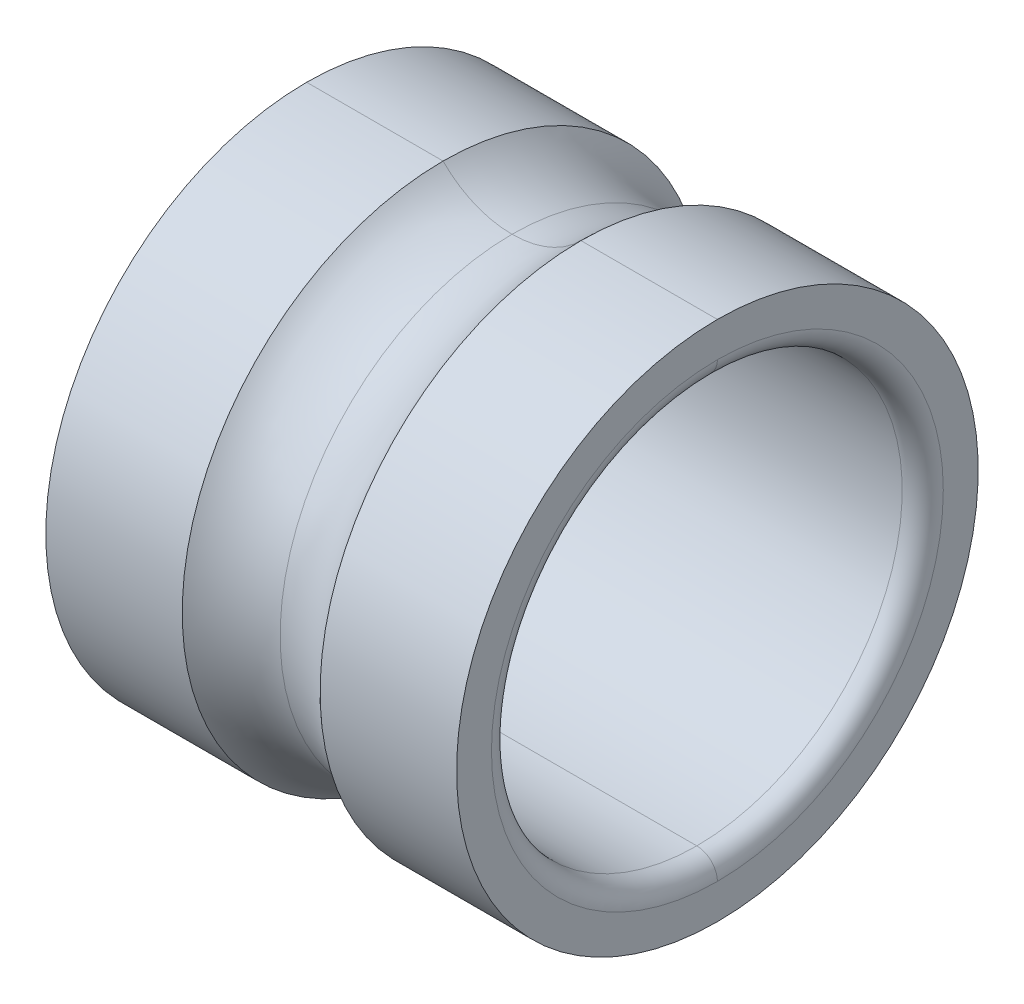
ISO-10303-21;
HEADER;
FILE_DESCRIPTION(('STEP AP214'),'2;1');
FILE_NAME('part.step','',(''),(''),'','','');
FILE_SCHEMA(('AUTOMOTIVE_DESIGN { 1 0 10303 214 1 1 1 1 }'));
ENDSEC;
DATA;
#1=APPLICATION_CONTEXT('core data for automotive mechanical design processes');
#2=APPLICATION_PROTOCOL_DEFINITION('international standard','automotive_design',2000,#1);
#3=PRODUCT_CONTEXT('',#1,'mechanical');
#4=PRODUCT('Part','Part','',(#3));
#5=PRODUCT_RELATED_PRODUCT_CATEGORY('part','',(#4));
#6=PRODUCT_DEFINITION_FORMATION('','',#4);
#7=PRODUCT_DEFINITION_CONTEXT('part definition',#1,'design');
#8=PRODUCT_DEFINITION('design','',#6,#7);
#9=PRODUCT_DEFINITION_SHAPE('','',#8);
#10=(LENGTH_UNIT() NAMED_UNIT(*) SI_UNIT(.MILLI.,.METRE.));
#11=(NAMED_UNIT(*) PLANE_ANGLE_UNIT() SI_UNIT($,.RADIAN.));
#12=(NAMED_UNIT(*) SI_UNIT($,.STERADIAN.) SOLID_ANGLE_UNIT());
#13=UNCERTAINTY_MEASURE_WITH_UNIT(LENGTH_MEASURE(1.E-05),#10,'distance_accuracy_value','');
#14=(GEOMETRIC_REPRESENTATION_CONTEXT(3) GLOBAL_UNCERTAINTY_ASSIGNED_CONTEXT((#13)) GLOBAL_UNIT_ASSIGNED_CONTEXT((#10,
#11,#12)) REPRESENTATION_CONTEXT('',''));
#15=CARTESIAN_POINT('',(0.,0.,0.));
#16=DIRECTION('',(0.,0.,1.));
#17=DIRECTION('',(1.,0.,0.));
#18=AXIS2_PLACEMENT_3D('',#15,#16,#17);
#19=CARTESIAN_POINT('',(-2.25171,0.,0.));
#20=DIRECTION('',(1.,0.,0.));
#21=DIRECTION('',(0.,-1.,0.));
#22=AXIS2_PLACEMENT_3D('',#19,#20,#21);
#23=TOROIDAL_SURFACE('',#22,2.75209,0.25019);
#24=CARTESIAN_POINT('',(-2.5019,0.,0.));
#25=DIRECTION('',(-1.,0.,0.));
#26=DIRECTION('',(0.,1.,0.));
#27=AXIS2_PLACEMENT_3D('',#24,#25,#26);
#28=CIRCLE('',#27,2.75209);
#29=CARTESIAN_POINT('',(-2.5019,2.75209,0.));
#30=VERTEX_POINT('',#29);
#31=CARTESIAN_POINT('',(-2.5019,-2.75209,0.));
#32=VERTEX_POINT('',#31);
#33=EDGE_CURVE('E169',#30,#32,#28,.T.);
#34=ORIENTED_EDGE('',*,*,#33,.T.);
#35=CARTESIAN_POINT('',(-2.25171,-2.75209,0.));
#36=DIRECTION('',(0.,0.,-1.));
#37=DIRECTION('',(-1.,0.,0.));
#38=AXIS2_PLACEMENT_3D('',#35,#36,#37);
#39=CIRCLE('',#38,0.25019);
#40=CARTESIAN_POINT('',(-2.25171,-2.5019,0.));
#41=VERTEX_POINT('',#40);
#42=EDGE_CURVE('E20',#32,#41,#39,.T.);
#43=ORIENTED_EDGE('',*,*,#42,.T.);
#44=CARTESIAN_POINT('',(-2.25171,0.,0.));
#45=DIRECTION('',(-1.,0.,0.));
#46=DIRECTION('',(0.,1.,0.));
#47=AXIS2_PLACEMENT_3D('',#44,#45,#46);
#48=CIRCLE('',#47,2.5019);
#49=CARTESIAN_POINT('',(-2.25171,2.5019,0.));
#50=VERTEX_POINT('',#49);
#51=EDGE_CURVE('E186',#50,#41,#48,.T.);
#52=ORIENTED_EDGE('',*,*,#51,.F.);
#53=CARTESIAN_POINT('',(-2.25171,2.75209,0.));
#54=DIRECTION('',(0.,0.,1.));
#55=DIRECTION('',(-1.,0.,0.));
#56=AXIS2_PLACEMENT_3D('',#53,#54,#55);
#57=CIRCLE('',#56,0.25019);
#58=EDGE_CURVE('E11',#30,#50,#57,.T.);
#59=ORIENTED_EDGE('',*,*,#58,.F.);
#60=EDGE_LOOP('',(#34,#43,#52,#59));
#61=FACE_BOUND('',#60,.T.);
#62=ADVANCED_FACE('F17',(#61),#23,.T.);
#63=CARTESIAN_POINT('',(-2.25171,0.,0.));
#64=DIRECTION('',(1.,0.,0.));
#65=DIRECTION('',(0.,-1.,0.));
#66=AXIS2_PLACEMENT_3D('',#63,#64,#65);
#67=TOROIDAL_SURFACE('',#66,2.75209,0.25019);
#68=CARTESIAN_POINT('',(-2.25171,0.,0.));
#69=DIRECTION('',(1.,0.,0.));
#70=DIRECTION('',(0.,1.,0.));
#71=AXIS2_PLACEMENT_3D('',#68,#69,#70);
#72=CIRCLE('',#71,2.5019);
#73=EDGE_CURVE('E130',#50,#41,#72,.T.);
#74=ORIENTED_EDGE('',*,*,#73,.T.);
#75=ORIENTED_EDGE('',*,*,#42,.F.);
#76=CARTESIAN_POINT('',(-2.5019,0.,0.));
#77=DIRECTION('',(1.,0.,0.));
#78=DIRECTION('',(0.,1.,0.));
#79=AXIS2_PLACEMENT_3D('',#76,#77,#78);
#80=CIRCLE('',#79,2.75209);
#81=EDGE_CURVE('E232',#30,#32,#80,.T.);
#82=ORIENTED_EDGE('',*,*,#81,.F.);
#83=ORIENTED_EDGE('',*,*,#58,.T.);
#84=EDGE_LOOP('',(#74,#75,#82,#83));
#85=FACE_BOUND('',#84,.T.);
#86=ADVANCED_FACE('F271',(#85),#67,.T.);
#87=CARTESIAN_POINT('',(-2.5019,0.,0.));
#88=DIRECTION('',(1.,0.,0.));
#89=DIRECTION('',(0.,1.,0.));
#90=AXIS2_PLACEMENT_3D('',#87,#88,#89);
#91=PLANE('',#90);
#92=ORIENTED_EDGE('',*,*,#33,.F.);
#93=ORIENTED_EDGE('',*,*,#81,.T.);
#94=EDGE_LOOP('',(#92,#93));
#95=FACE_BOUND('',#94,.T.);
#96=CARTESIAN_POINT('',(-2.5019,0.,0.));
#97=DIRECTION('',(1.,0.,0.));
#98=DIRECTION('',(0.,1.,0.));
#99=AXIS2_PLACEMENT_3D('',#96,#97,#98);
#100=CIRCLE('',#99,3.1773749);
#101=CARTESIAN_POINT('',(-2.5019,3.1773749,0.));
#102=VERTEX_POINT('',#101);
#103=CARTESIAN_POINT('',(-2.5019,-3.1773749,0.));
#104=VERTEX_POINT('',#103);
#105=EDGE_CURVE('E156',#102,#104,#100,.T.);
#106=ORIENTED_EDGE('',*,*,#105,.F.);
#107=CARTESIAN_POINT('',(-2.5019,0.,0.));
#108=DIRECTION('',(-1.,0.,0.));
#109=DIRECTION('',(0.,1.,0.));
#110=AXIS2_PLACEMENT_3D('',#107,#108,#109);
#111=CIRCLE('',#110,3.1773749);
#112=EDGE_CURVE('E141',#102,#104,#111,.T.);
#113=ORIENTED_EDGE('',*,*,#112,.T.);
#114=EDGE_LOOP('',(#106,#113));
#115=FACE_BOUND('',#114,.T.);
#116=ADVANCED_FACE('F276',(#95,#115),#91,.F.);
#117=CARTESIAN_POINT('',(-2.75209,0.,0.));
#118=DIRECTION('',(1.,0.,0.));
#119=DIRECTION('',(0.,-1.,0.));
#120=AXIS2_PLACEMENT_3D('',#117,#118,#119);
#121=CYLINDRICAL_SURFACE('',#120,3.1773749);
#122=CARTESIAN_POINT('',(-0.839755569912454,0.,0.));
#123=DIRECTION('',(-1.,0.,0.));
#124=DIRECTION('',(0.,1.,0.));
#125=AXIS2_PLACEMENT_3D('',#122,#123,#124);
#126=CIRCLE('',#125,3.1773749);
#127=CARTESIAN_POINT('',(-0.839755569912454,3.1773749,0.));
#128=VERTEX_POINT('',#127);
#129=CARTESIAN_POINT('',(-0.839755569912454,-3.1773749,0.));
#130=VERTEX_POINT('',#129);
#131=EDGE_CURVE('E147',#128,#130,#126,.T.);
#132=ORIENTED_EDGE('',*,*,#131,.T.);
#133=DIRECTION('',(-1.,0.,0.));
#134=VECTOR('',#133,1.);
#135=CARTESIAN_POINT('',(-0.839755569912453,-3.1773749,0.));
#136=LINE('',#135,#134);
#137=EDGE_CURVE('E160',#130,#104,#136,.T.);
#138=ORIENTED_EDGE('',*,*,#137,.T.);
#139=ORIENTED_EDGE('',*,*,#112,.F.);
#140=DIRECTION('',(-1.,0.,0.));
#141=VECTOR('',#140,1.);
#142=CARTESIAN_POINT('',(-0.839755569912453,3.1773749,0.));
#143=LINE('',#142,#141);
#144=EDGE_CURVE('E157',#128,#102,#143,.T.);
#145=ORIENTED_EDGE('',*,*,#144,.F.);
#146=EDGE_LOOP('',(#132,#138,#139,#145));
#147=FACE_BOUND('',#146,.T.);
#148=ADVANCED_FACE('F255',(#147),#121,.T.);
#149=CARTESIAN_POINT('',(-2.75209,0.,0.));
#150=DIRECTION('',(1.,0.,0.));
#151=DIRECTION('',(0.,-1.,0.));
#152=AXIS2_PLACEMENT_3D('',#149,#150,#151);
#153=CYLINDRICAL_SURFACE('',#152,3.1773749);
#154=ORIENTED_EDGE('',*,*,#105,.T.);
#155=ORIENTED_EDGE('',*,*,#137,.F.);
#156=CARTESIAN_POINT('',(-0.839755569912454,0.,0.));
#157=DIRECTION('',(1.,0.,0.));
#158=DIRECTION('',(0.,1.,0.));
#159=AXIS2_PLACEMENT_3D('',#156,#157,#158);
#160=CIRCLE('',#159,3.1773749);
#161=EDGE_CURVE('E153',#128,#130,#160,.T.);
#162=ORIENTED_EDGE('',*,*,#161,.F.);
#163=ORIENTED_EDGE('',*,*,#144,.T.);
#164=EDGE_LOOP('',(#154,#155,#162,#163));
#165=FACE_BOUND('',#164,.T.);
#166=ADVANCED_FACE('F268',(#165),#153,.T.);
#167=CARTESIAN_POINT('',(0.,0.,0.));
#168=DIRECTION('',(1.,0.,0.));
#169=DIRECTION('',(0.,-1.,0.));
#170=AXIS2_PLACEMENT_3D('',#167,#168,#169);
#171=TOROIDAL_SURFACE('',#170,4.0005,1.175893);
#172=CARTESIAN_POINT('',(0.,0.,0.));
#173=DIRECTION('',(1.,0.,0.));
#174=DIRECTION('',(0.,0.,-1.));
#175=AXIS2_PLACEMENT_3D('',#172,#173,#174);
#176=CIRCLE('',#175,2.824607);
#177=CARTESIAN_POINT('',(0.,2.824607,0.));
#178=VERTEX_POINT('',#177);
#179=CARTESIAN_POINT('',(0.,-2.824607,0.));
#180=VERTEX_POINT('',#179);
#181=EDGE_CURVE('E202',#178,#180,#176,.T.);
#182=ORIENTED_EDGE('',*,*,#181,.F.);
#183=CARTESIAN_POINT('',(0.,4.0005,0.));
#184=DIRECTION('',(0.,0.,-1.));
#185=DIRECTION('',(0.714142842854284,-0.7,0.));
#186=AXIS2_PLACEMENT_3D('',#183,#184,#185);
#187=CIRCLE('',#186,1.175893);
#188=EDGE_CURVE('E151',#178,#128,#187,.T.);
#189=ORIENTED_EDGE('',*,*,#188,.T.);
#190=ORIENTED_EDGE('',*,*,#161,.T.);
#191=CARTESIAN_POINT('',(0.,-4.0005,0.));
#192=DIRECTION('',(0.,0.,1.));
#193=DIRECTION('',(0.714142842854284,0.7,0.));
#194=AXIS2_PLACEMENT_3D('',#191,#192,#193);
#195=CIRCLE('',#194,1.175893);
#196=EDGE_CURVE('E152',#180,#130,#195,.T.);
#197=ORIENTED_EDGE('',*,*,#196,.F.);
#198=EDGE_LOOP('',(#182,#189,#190,#197));
#199=FACE_BOUND('',#198,.T.);
#200=ADVANCED_FACE('F254',(#199),#171,.F.);
#201=CARTESIAN_POINT('',(0.,0.,0.));
#202=DIRECTION('',(1.,0.,0.));
#203=DIRECTION('',(0.,-1.,0.));
#204=AXIS2_PLACEMENT_3D('',#201,#202,#203);
#205=TOROIDAL_SURFACE('',#204,4.0005,1.175893);
#206=CARTESIAN_POINT('',(0.,0.,0.));
#207=DIRECTION('',(1.,0.,0.));
#208=DIRECTION('',(0.,0.,-1.));
#209=AXIS2_PLACEMENT_3D('',#206,#207,#208);
#210=CIRCLE('',#209,2.824607);
#211=EDGE_CURVE('E208',#180,#178,#210,.T.);
#212=ORIENTED_EDGE('',*,*,#211,.F.);
#213=ORIENTED_EDGE('',*,*,#196,.T.);
#214=ORIENTED_EDGE('',*,*,#131,.F.);
#215=ORIENTED_EDGE('',*,*,#188,.F.);
#216=EDGE_LOOP('',(#212,#213,#214,#215));
#217=FACE_BOUND('',#216,.T.);
#218=ADVANCED_FACE('F256',(#217),#205,.F.);
#219=CARTESIAN_POINT('',(-2.75209,0.,0.));
#220=DIRECTION('',(1.,0.,0.));
#221=DIRECTION('',(0.,-1.,0.));
#222=AXIS2_PLACEMENT_3D('',#219,#220,#221);
#223=CYLINDRICAL_SURFACE('',#222,3.1773749);
#224=CARTESIAN_POINT('',(2.5019,0.,0.));
#225=DIRECTION('',(-1.,0.,0.));
#226=DIRECTION('',(0.,1.,0.));
#227=AXIS2_PLACEMENT_3D('',#224,#225,#226);
#228=CIRCLE('',#227,3.1773749);
#229=CARTESIAN_POINT('',(2.5019,3.1773749,0.));
#230=VERTEX_POINT('',#229);
#231=CARTESIAN_POINT('',(2.5019,-3.1773749,0.));
#232=VERTEX_POINT('',#231);
#233=EDGE_CURVE('E117',#230,#232,#228,.T.);
#234=ORIENTED_EDGE('',*,*,#233,.T.);
#235=DIRECTION('',(-1.,0.,0.));
#236=VECTOR('',#235,1.);
#237=CARTESIAN_POINT('',(2.5019,-3.1773749,0.));
#238=LINE('',#237,#236);
#239=CARTESIAN_POINT('',(0.839755569912453,-3.1773749,0.));
#240=VERTEX_POINT('',#239);
#241=EDGE_CURVE('E193',#232,#240,#238,.T.);
#242=ORIENTED_EDGE('',*,*,#241,.T.);
#243=CARTESIAN_POINT('',(0.839755569912454,0.,0.));
#244=DIRECTION('',(-1.,0.,0.));
#245=DIRECTION('',(0.,1.,0.));
#246=AXIS2_PLACEMENT_3D('',#243,#244,#245);
#247=CIRCLE('',#246,3.1773749);
#248=CARTESIAN_POINT('',(0.839755569912453,3.1773749,0.));
#249=VERTEX_POINT('',#248);
#250=EDGE_CURVE('E196',#249,#240,#247,.T.);
#251=ORIENTED_EDGE('',*,*,#250,.F.);
#252=DIRECTION('',(-1.,0.,0.));
#253=VECTOR('',#252,1.);
#254=CARTESIAN_POINT('',(2.5019,3.1773749,0.));
#255=LINE('',#254,#253);
#256=EDGE_CURVE('E201',#230,#249,#255,.T.);
#257=ORIENTED_EDGE('',*,*,#256,.F.);
#258=EDGE_LOOP('',(#234,#242,#251,#257));
#259=FACE_BOUND('',#258,.T.);
#260=ADVANCED_FACE('F258',(#259),#223,.T.);
#261=CARTESIAN_POINT('',(-2.75209,0.,0.));
#262=DIRECTION('',(1.,0.,0.));
#263=DIRECTION('',(0.,-1.,0.));
#264=AXIS2_PLACEMENT_3D('',#261,#262,#263);
#265=CYLINDRICAL_SURFACE('',#264,3.1773749);
#266=CARTESIAN_POINT('',(0.839755569912454,0.,0.));
#267=DIRECTION('',(1.,0.,0.));
#268=DIRECTION('',(0.,1.,0.));
#269=AXIS2_PLACEMENT_3D('',#266,#267,#268);
#270=CIRCLE('',#269,3.1773749);
#271=EDGE_CURVE('E179',#249,#240,#270,.T.);
#272=ORIENTED_EDGE('',*,*,#271,.T.);
#273=ORIENTED_EDGE('',*,*,#241,.F.);
#274=CARTESIAN_POINT('',(2.5019,0.,0.));
#275=DIRECTION('',(1.,0.,0.));
#276=DIRECTION('',(0.,1.,0.));
#277=AXIS2_PLACEMENT_3D('',#274,#275,#276);
#278=CIRCLE('',#277,3.1773749);
#279=EDGE_CURVE('E146',#230,#232,#278,.T.);
#280=ORIENTED_EDGE('',*,*,#279,.F.);
#281=ORIENTED_EDGE('',*,*,#256,.T.);
#282=EDGE_LOOP('',(#272,#273,#280,#281));
#283=FACE_BOUND('',#282,.T.);
#284=ADVANCED_FACE('F265',(#283),#265,.T.);
#285=CARTESIAN_POINT('',(2.5019,0.,0.));
#286=DIRECTION('',(1.,0.,0.));
#287=DIRECTION('',(0.,1.,0.));
#288=AXIS2_PLACEMENT_3D('',#285,#286,#287);
#289=PLANE('',#288);
#290=CARTESIAN_POINT('',(2.5019,0.,0.));
#291=DIRECTION('',(1.,0.,0.));
#292=DIRECTION('',(0.,1.,0.));
#293=AXIS2_PLACEMENT_3D('',#290,#291,#292);
#294=CIRCLE('',#293,2.75209);
#295=CARTESIAN_POINT('',(2.5019,2.75209,0.));
#296=VERTEX_POINT('',#295);
#297=CARTESIAN_POINT('',(2.5019,-2.75209,0.));
#298=VERTEX_POINT('',#297);
#299=EDGE_CURVE('E121',#296,#298,#294,.T.);
#300=ORIENTED_EDGE('',*,*,#299,.F.);
#301=CARTESIAN_POINT('',(2.5019,0.,0.));
#302=DIRECTION('',(-1.,0.,0.));
#303=DIRECTION('',(0.,1.,0.));
#304=AXIS2_PLACEMENT_3D('',#301,#302,#303);
#305=CIRCLE('',#304,2.75209);
#306=EDGE_CURVE('E103',#296,#298,#305,.T.);
#307=ORIENTED_EDGE('',*,*,#306,.T.);
#308=EDGE_LOOP('',(#300,#307));
#309=FACE_BOUND('',#308,.T.);
#310=ORIENTED_EDGE('',*,*,#233,.F.);
#311=ORIENTED_EDGE('',*,*,#279,.T.);
#312=EDGE_LOOP('',(#310,#311));
#313=FACE_BOUND('',#312,.T.);
#314=ADVANCED_FACE('F127',(#309,#313),#289,.T.);
#315=CARTESIAN_POINT('',(2.25171,0.,0.));
#316=DIRECTION('',(1.,0.,0.));
#317=DIRECTION('',(0.,-1.,0.));
#318=AXIS2_PLACEMENT_3D('',#315,#316,#317);
#319=TOROIDAL_SURFACE('',#318,2.75209,0.25019);
#320=CARTESIAN_POINT('',(2.25171,0.,0.));
#321=DIRECTION('',(-1.,0.,0.));
#322=DIRECTION('',(0.,1.,0.));
#323=AXIS2_PLACEMENT_3D('',#320,#321,#322);
#324=CIRCLE('',#323,2.5019);
#325=CARTESIAN_POINT('',(2.25171,2.5019,0.));
#326=VERTEX_POINT('',#325);
#327=CARTESIAN_POINT('',(2.25171,-2.5019,0.));
#328=VERTEX_POINT('',#327);
#329=EDGE_CURVE('E185',#326,#328,#324,.T.);
#330=ORIENTED_EDGE('',*,*,#329,.T.);
#331=CARTESIAN_POINT('',(2.25171,-2.75209,0.));
#332=DIRECTION('',(0.,0.,-1.));
#333=DIRECTION('',(0.,1.,0.));
#334=AXIS2_PLACEMENT_3D('',#331,#332,#333);
#335=CIRCLE('',#334,0.25019);
#336=EDGE_CURVE('E114',#328,#298,#335,.T.);
#337=ORIENTED_EDGE('',*,*,#336,.T.);
#338=ORIENTED_EDGE('',*,*,#306,.F.);
#339=CARTESIAN_POINT('',(2.25171,2.75209,0.));
#340=DIRECTION('',(0.,0.,1.));
#341=DIRECTION('',(0.,-1.,0.));
#342=AXIS2_PLACEMENT_3D('',#339,#340,#341);
#343=CIRCLE('',#342,0.25019);
#344=EDGE_CURVE('E112',#326,#296,#343,.T.);
#345=ORIENTED_EDGE('',*,*,#344,.F.);
#346=EDGE_LOOP('',(#330,#337,#338,#345));
#347=FACE_BOUND('',#346,.T.);
#348=ADVANCED_FACE('F111',(#347),#319,.T.);
#349=CARTESIAN_POINT('',(2.25171,0.,0.));
#350=DIRECTION('',(1.,0.,0.));
#351=DIRECTION('',(0.,-1.,0.));
#352=AXIS2_PLACEMENT_3D('',#349,#350,#351);
#353=TOROIDAL_SURFACE('',#352,2.75209,0.25019);
#354=ORIENTED_EDGE('',*,*,#299,.T.);
#355=ORIENTED_EDGE('',*,*,#336,.F.);
#356=CARTESIAN_POINT('',(2.25171,0.,0.));
#357=DIRECTION('',(1.,0.,0.));
#358=DIRECTION('',(0.,1.,0.));
#359=AXIS2_PLACEMENT_3D('',#356,#357,#358);
#360=CIRCLE('',#359,2.5019);
#361=EDGE_CURVE('E123',#326,#328,#360,.T.);
#362=ORIENTED_EDGE('',*,*,#361,.F.);
#363=ORIENTED_EDGE('',*,*,#344,.T.);
#364=EDGE_LOOP('',(#354,#355,#362,#363));
#365=FACE_BOUND('',#364,.T.);
#366=ADVANCED_FACE('F120',(#365),#353,.T.);
#367=CARTESIAN_POINT('',(-2.75209,0.,0.));
#368=DIRECTION('',(1.,0.,0.));
#369=DIRECTION('',(0.,-1.,0.));
#370=AXIS2_PLACEMENT_3D('',#367,#368,#369);
#371=CYLINDRICAL_SURFACE('',#370,2.5019);
#372=ORIENTED_EDGE('',*,*,#361,.T.);
#373=DIRECTION('',(1.,0.,0.));
#374=VECTOR('',#373,1.);
#375=CARTESIAN_POINT('',(-2.25171,-2.5019,0.));
#376=LINE('',#375,#374);
#377=EDGE_CURVE('E181',#41,#328,#376,.T.);
#378=ORIENTED_EDGE('',*,*,#377,.F.);
#379=ORIENTED_EDGE('',*,*,#73,.F.);
#380=DIRECTION('',(1.,0.,0.));
#381=VECTOR('',#380,1.);
#382=CARTESIAN_POINT('',(-2.25171,2.5019,0.));
#383=LINE('',#382,#381);
#384=EDGE_CURVE('E236',#50,#326,#383,.T.);
#385=ORIENTED_EDGE('',*,*,#384,.T.);
#386=EDGE_LOOP('',(#372,#378,#379,#385));
#387=FACE_BOUND('',#386,.T.);
#388=ADVANCED_FACE('F291',(#387),#371,.F.);
#389=CARTESIAN_POINT('',(-2.75209,0.,0.));
#390=DIRECTION('',(1.,0.,0.));
#391=DIRECTION('',(0.,-1.,0.));
#392=AXIS2_PLACEMENT_3D('',#389,#390,#391);
#393=CYLINDRICAL_SURFACE('',#392,2.5019);
#394=ORIENTED_EDGE('',*,*,#51,.T.);
#395=ORIENTED_EDGE('',*,*,#377,.T.);
#396=ORIENTED_EDGE('',*,*,#329,.F.);
#397=ORIENTED_EDGE('',*,*,#384,.F.);
#398=EDGE_LOOP('',(#394,#395,#396,#397));
#399=FACE_BOUND('',#398,.T.);
#400=ADVANCED_FACE('F297',(#399),#393,.F.);
#401=CARTESIAN_POINT('',(0.,0.,0.));
#402=DIRECTION('',(1.,0.,0.));
#403=DIRECTION('',(0.,-1.,0.));
#404=AXIS2_PLACEMENT_3D('',#401,#402,#403);
#405=TOROIDAL_SURFACE('',#404,4.0005,1.175893);
#406=CARTESIAN_POINT('',(0.,-4.0005,0.));
#407=DIRECTION('',(0.,0.,1.));
#408=DIRECTION('',(0.714142842854284,0.7,0.));
#409=AXIS2_PLACEMENT_3D('',#406,#407,#408);
#410=CIRCLE('',#409,1.175893);
#411=EDGE_CURVE('E206',#240,#180,#410,.T.);
#412=ORIENTED_EDGE('',*,*,#411,.T.);
#413=ORIENTED_EDGE('',*,*,#211,.T.);
#414=CARTESIAN_POINT('',(0.,4.0005,0.));
#415=DIRECTION('',(0.,0.,-1.));
#416=DIRECTION('',(0.714142842854284,-0.7,0.));
#417=AXIS2_PLACEMENT_3D('',#414,#415,#416);
#418=CIRCLE('',#417,1.175893);
#419=EDGE_CURVE('E207',#249,#178,#418,.T.);
#420=ORIENTED_EDGE('',*,*,#419,.F.);
#421=ORIENTED_EDGE('',*,*,#250,.T.);
#422=EDGE_LOOP('',(#412,#413,#420,#421));
#423=FACE_BOUND('',#422,.T.);
#424=ADVANCED_FACE('F252',(#423),#405,.F.);
#425=CARTESIAN_POINT('',(0.,0.,0.));
#426=DIRECTION('',(1.,0.,0.));
#427=DIRECTION('',(0.,-1.,0.));
#428=AXIS2_PLACEMENT_3D('',#425,#426,#427);
#429=TOROIDAL_SURFACE('',#428,4.0005,1.175893);
#430=ORIENTED_EDGE('',*,*,#419,.T.);
#431=ORIENTED_EDGE('',*,*,#181,.T.);
#432=ORIENTED_EDGE('',*,*,#411,.F.);
#433=ORIENTED_EDGE('',*,*,#271,.F.);
#434=EDGE_LOOP('',(#430,#431,#432,#433));
#435=FACE_BOUND('',#434,.T.);
#436=ADVANCED_FACE('F248',(#435),#429,.F.);
#437=CLOSED_SHELL('',(#62,#86,#116,#148,#166,#200,#218,#260,#284,#314,#348,#366,#388,#400,#424,#436));
#438=MANIFOLD_SOLID_BREP('B1',#437);
#439=ADVANCED_BREP_SHAPE_REPRESENTATION('',(#18,#438),#14);
#440=SHAPE_DEFINITION_REPRESENTATION(#9,#439);
ENDSEC;
END-ISO-10303-21;
